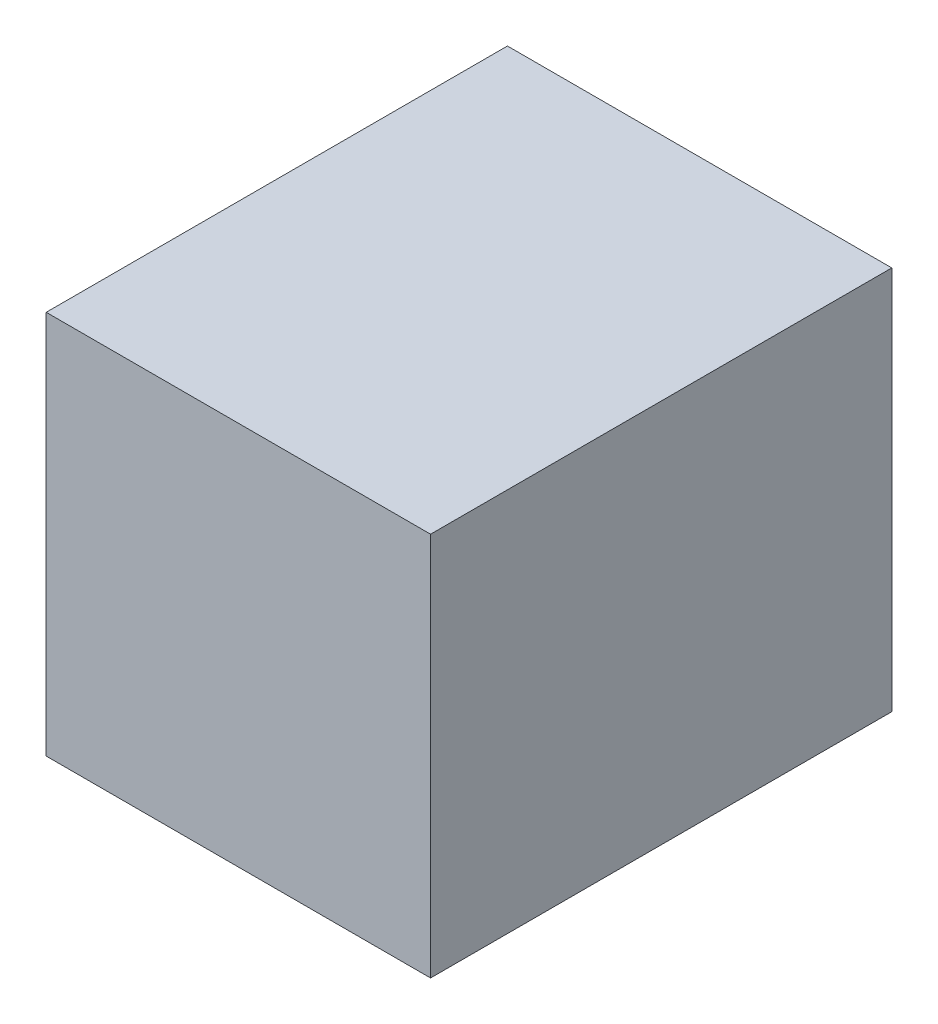
ISO-10303-21;
HEADER;
FILE_DESCRIPTION(('STEP AP214'),'2;1');
FILE_NAME('part.step','',(''),(''),'','','');
FILE_SCHEMA(('AUTOMOTIVE_DESIGN { 1 0 10303 214 1 1 1 1 }'));
ENDSEC;
DATA;
#1=APPLICATION_CONTEXT('core data for automotive mechanical design processes');
#2=APPLICATION_PROTOCOL_DEFINITION('international standard','automotive_design',2000,#1);
#3=PRODUCT_CONTEXT('',#1,'mechanical');
#4=PRODUCT('Part','Part','',(#3));
#5=PRODUCT_RELATED_PRODUCT_CATEGORY('part','',(#4));
#6=PRODUCT_DEFINITION_FORMATION('','',#4);
#7=PRODUCT_DEFINITION_CONTEXT('part definition',#1,'design');
#8=PRODUCT_DEFINITION('design','',#6,#7);
#9=PRODUCT_DEFINITION_SHAPE('','',#8);
#10=(LENGTH_UNIT() NAMED_UNIT(*) SI_UNIT(.MILLI.,.METRE.));
#11=(NAMED_UNIT(*) PLANE_ANGLE_UNIT() SI_UNIT($,.RADIAN.));
#12=(NAMED_UNIT(*) SI_UNIT($,.STERADIAN.) SOLID_ANGLE_UNIT());
#13=UNCERTAINTY_MEASURE_WITH_UNIT(LENGTH_MEASURE(1.E-05),#10,'distance_accuracy_value','');
#14=(GEOMETRIC_REPRESENTATION_CONTEXT(3) GLOBAL_UNCERTAINTY_ASSIGNED_CONTEXT((#13)) GLOBAL_UNIT_ASSIGNED_CONTEXT((#10,
#11,#12)) REPRESENTATION_CONTEXT('',''));
#15=CARTESIAN_POINT('',(0.,0.,0.));
#16=DIRECTION('',(0.,0.,1.));
#17=DIRECTION('',(1.,0.,0.));
#18=AXIS2_PLACEMENT_3D('',#15,#16,#17);
#19=CARTESIAN_POINT('',(2.5,-2.5,6.));
#20=DIRECTION('',(-1.,0.,0.));
#21=DIRECTION('',(0.,0.,1.));
#22=AXIS2_PLACEMENT_3D('',#19,#20,#21);
#23=PLANE('',#22);
#24=DIRECTION('',(0.,1.,0.));
#25=VECTOR('',#24,1.);
#26=CARTESIAN_POINT('',(2.5,-2.5,0.));
#27=LINE('',#26,#25);
#28=CARTESIAN_POINT('',(2.5,-2.5,0.));
#29=VERTEX_POINT('',#28);
#30=CARTESIAN_POINT('',(2.5,2.5,0.));
#31=VERTEX_POINT('',#30);
#32=EDGE_CURVE('E96',#29,#31,#27,.T.);
#33=ORIENTED_EDGE('',*,*,#32,.T.);
#34=DIRECTION('',(0.,0.,-1.));
#35=VECTOR('',#34,1.);
#36=CARTESIAN_POINT('',(2.5,2.5,6.));
#37=LINE('',#36,#35);
#38=CARTESIAN_POINT('',(2.5,2.5,6.));
#39=VERTEX_POINT('',#38);
#40=EDGE_CURVE('E11',#39,#31,#37,.T.);
#41=ORIENTED_EDGE('',*,*,#40,.F.);
#42=DIRECTION('',(0.,1.,0.));
#43=VECTOR('',#42,1.);
#44=CARTESIAN_POINT('',(2.5,-2.5,6.));
#45=LINE('',#44,#43);
#46=CARTESIAN_POINT('',(2.5,-2.5,6.));
#47=VERTEX_POINT('',#46);
#48=EDGE_CURVE('E84',#47,#39,#45,.T.);
#49=ORIENTED_EDGE('',*,*,#48,.F.);
#50=DIRECTION('',(0.,0.,-1.));
#51=VECTOR('',#50,1.);
#52=CARTESIAN_POINT('',(2.5,-2.5,6.));
#53=LINE('',#52,#51);
#54=EDGE_CURVE('E92',#47,#29,#53,.T.);
#55=ORIENTED_EDGE('',*,*,#54,.T.);
#56=EDGE_LOOP('',(#33,#41,#49,#55));
#57=FACE_BOUND('',#56,.T.);
#58=ADVANCED_FACE('F33',(#57),#23,.F.);
#59=CARTESIAN_POINT('',(-2.5,2.5,6.));
#60=DIRECTION('',(0.,-1.,0.));
#61=DIRECTION('',(0.,0.,-1.));
#62=AXIS2_PLACEMENT_3D('',#59,#60,#61);
#63=PLANE('',#62);
#64=DIRECTION('',(-1.,0.,0.));
#65=VECTOR('',#64,1.);
#66=CARTESIAN_POINT('',(-2.5,2.5,0.));
#67=LINE('',#66,#65);
#68=CARTESIAN_POINT('',(-2.5,2.5,0.));
#69=VERTEX_POINT('',#68);
#70=EDGE_CURVE('E88',#31,#69,#67,.T.);
#71=ORIENTED_EDGE('',*,*,#70,.T.);
#72=DIRECTION('',(0.,0.,-1.));
#73=VECTOR('',#72,1.);
#74=CARTESIAN_POINT('',(-2.5,2.5,6.));
#75=LINE('',#74,#73);
#76=CARTESIAN_POINT('',(-2.5,2.5,6.));
#77=VERTEX_POINT('',#76);
#78=EDGE_CURVE('E41',#77,#69,#75,.T.);
#79=ORIENTED_EDGE('',*,*,#78,.F.);
#80=DIRECTION('',(-1.,0.,0.));
#81=VECTOR('',#80,1.);
#82=CARTESIAN_POINT('',(-2.5,2.5,6.));
#83=LINE('',#82,#81);
#84=EDGE_CURVE('E79',#39,#77,#83,.T.);
#85=ORIENTED_EDGE('',*,*,#84,.F.);
#86=ORIENTED_EDGE('',*,*,#40,.T.);
#87=EDGE_LOOP('',(#71,#79,#85,#86));
#88=FACE_BOUND('',#87,.T.);
#89=ADVANCED_FACE('F87',(#88),#63,.F.);
#90=CARTESIAN_POINT('',(-2.5,-2.5,6.));
#91=DIRECTION('',(1.,0.,0.));
#92=DIRECTION('',(0.,0.,-1.));
#93=AXIS2_PLACEMENT_3D('',#90,#91,#92);
#94=PLANE('',#93);
#95=DIRECTION('',(0.,-1.,0.));
#96=VECTOR('',#95,1.);
#97=CARTESIAN_POINT('',(-2.5,-2.5,0.));
#98=LINE('',#97,#96);
#99=CARTESIAN_POINT('',(-2.5,-2.5,0.));
#100=VERTEX_POINT('',#99);
#101=EDGE_CURVE('E66',#69,#100,#98,.T.);
#102=ORIENTED_EDGE('',*,*,#101,.T.);
#103=DIRECTION('',(0.,0.,-1.));
#104=VECTOR('',#103,1.);
#105=CARTESIAN_POINT('',(-2.5,-2.5,6.));
#106=LINE('',#105,#104);
#107=CARTESIAN_POINT('',(-2.5,-2.5,6.));
#108=VERTEX_POINT('',#107);
#109=EDGE_CURVE('E89',#108,#100,#106,.T.);
#110=ORIENTED_EDGE('',*,*,#109,.F.);
#111=DIRECTION('',(0.,-1.,0.));
#112=VECTOR('',#111,1.);
#113=CARTESIAN_POINT('',(-2.5,-2.5,6.));
#114=LINE('',#113,#112);
#115=EDGE_CURVE('E82',#77,#108,#114,.T.);
#116=ORIENTED_EDGE('',*,*,#115,.F.);
#117=ORIENTED_EDGE('',*,*,#78,.T.);
#118=EDGE_LOOP('',(#102,#110,#116,#117));
#119=FACE_BOUND('',#118,.T.);
#120=ADVANCED_FACE('F90',(#119),#94,.F.);
#121=CARTESIAN_POINT('',(-2.5,-2.5,6.));
#122=DIRECTION('',(0.,1.,0.));
#123=DIRECTION('',(0.,0.,1.));
#124=AXIS2_PLACEMENT_3D('',#121,#122,#123);
#125=PLANE('',#124);
#126=DIRECTION('',(1.,0.,0.));
#127=VECTOR('',#126,1.);
#128=CARTESIAN_POINT('',(-2.5,-2.5,0.));
#129=LINE('',#128,#127);
#130=EDGE_CURVE('E72',#100,#29,#129,.T.);
#131=ORIENTED_EDGE('',*,*,#130,.T.);
#132=ORIENTED_EDGE('',*,*,#54,.F.);
#133=DIRECTION('',(1.,0.,0.));
#134=VECTOR('',#133,1.);
#135=CARTESIAN_POINT('',(-2.5,-2.5,6.));
#136=LINE('',#135,#134);
#137=EDGE_CURVE('E49',#108,#47,#136,.T.);
#138=ORIENTED_EDGE('',*,*,#137,.F.);
#139=ORIENTED_EDGE('',*,*,#109,.T.);
#140=EDGE_LOOP('',(#131,#132,#138,#139));
#141=FACE_BOUND('',#140,.T.);
#142=ADVANCED_FACE('F103',(#141),#125,.F.);
#143=CARTESIAN_POINT('',(0.,0.,6.));
#144=DIRECTION('',(0.,0.,-1.));
#145=DIRECTION('',(-1.,0.,0.));
#146=AXIS2_PLACEMENT_3D('',#143,#144,#145);
#147=PLANE('',#146);
#148=ORIENTED_EDGE('',*,*,#48,.T.);
#149=ORIENTED_EDGE('',*,*,#84,.T.);
#150=ORIENTED_EDGE('',*,*,#115,.T.);
#151=ORIENTED_EDGE('',*,*,#137,.T.);
#152=EDGE_LOOP('',(#148,#149,#150,#151));
#153=FACE_BOUND('',#152,.T.);
#154=ADVANCED_FACE('F80',(#153),#147,.F.);
#155=CARTESIAN_POINT('',(0.,0.,0.));
#156=DIRECTION('',(0.,0.,-1.));
#157=DIRECTION('',(-1.,0.,0.));
#158=AXIS2_PLACEMENT_3D('',#155,#156,#157);
#159=PLANE('',#158);
#160=ORIENTED_EDGE('',*,*,#32,.F.);
#161=ORIENTED_EDGE('',*,*,#130,.F.);
#162=ORIENTED_EDGE('',*,*,#101,.F.);
#163=ORIENTED_EDGE('',*,*,#70,.F.);
#164=EDGE_LOOP('',(#160,#161,#162,#163));
#165=FACE_BOUND('',#164,.T.);
#166=ADVANCED_FACE('F106',(#165),#159,.T.);
#167=CLOSED_SHELL('',(#58,#89,#120,#142,#154,#166));
#168=MANIFOLD_SOLID_BREP('B2',#167);
#169=ADVANCED_BREP_SHAPE_REPRESENTATION('',(#18,#168),#14);
#170=SHAPE_DEFINITION_REPRESENTATION(#9,#169);
ENDSEC;
END-ISO-10303-21;
